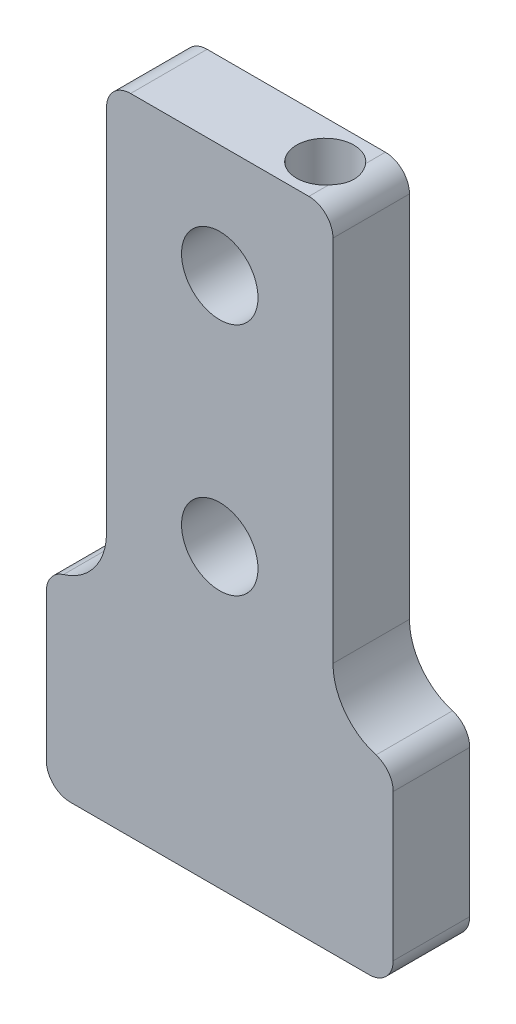
ISO-10303-21;
HEADER;
FILE_DESCRIPTION(('STEP AP214'),'2;1');
FILE_NAME('part.step','',(''),(''),'','','');
FILE_SCHEMA(('AUTOMOTIVE_DESIGN { 1 0 10303 214 1 1 1 1 }'));
ENDSEC;
DATA;
#1=APPLICATION_CONTEXT('core data for automotive mechanical design processes');
#2=APPLICATION_PROTOCOL_DEFINITION('international standard','automotive_design',2000,#1);
#3=PRODUCT_CONTEXT('',#1,'mechanical');
#4=PRODUCT('Part','Part','',(#3));
#5=PRODUCT_RELATED_PRODUCT_CATEGORY('part','',(#4));
#6=PRODUCT_DEFINITION_FORMATION('','',#4);
#7=PRODUCT_DEFINITION_CONTEXT('part definition',#1,'design');
#8=PRODUCT_DEFINITION('design','',#6,#7);
#9=PRODUCT_DEFINITION_SHAPE('','',#8);
#10=(LENGTH_UNIT() NAMED_UNIT(*) SI_UNIT(.MILLI.,.METRE.));
#11=(NAMED_UNIT(*) PLANE_ANGLE_UNIT() SI_UNIT($,.RADIAN.));
#12=(NAMED_UNIT(*) SI_UNIT($,.STERADIAN.) SOLID_ANGLE_UNIT());
#13=UNCERTAINTY_MEASURE_WITH_UNIT(LENGTH_MEASURE(1.E-05),#10,'distance_accuracy_value','');
#14=(GEOMETRIC_REPRESENTATION_CONTEXT(3) GLOBAL_UNCERTAINTY_ASSIGNED_CONTEXT((#13)) GLOBAL_UNIT_ASSIGNED_CONTEXT((#10,
#11,#12)) REPRESENTATION_CONTEXT('',''));
#15=CARTESIAN_POINT('',(0.,0.,0.));
#16=DIRECTION('',(0.,0.,1.));
#17=DIRECTION('',(1.,0.,0.));
#18=AXIS2_PLACEMENT_3D('',#15,#16,#17);
#19=CARTESIAN_POINT('',(-14.398,-3.7,-6.35));
#20=DIRECTION('',(0.,0.,1.));
#21=DIRECTION('',(1.,0.,0.));
#22=AXIS2_PLACEMENT_3D('',#19,#20,#21);
#23=CYLINDRICAL_SURFACE('',#22,5.);
#24=CARTESIAN_POINT('',(-14.398,-3.7,-6.35));
#25=DIRECTION('',(0.,0.,-1.));
#26=DIRECTION('',(1.,0.,0.));
#27=AXIS2_PLACEMENT_3D('',#24,#25,#26);
#28=CIRCLE('',#27,5.);
#29=CARTESIAN_POINT('',(-9.398,-3.7,-6.35));
#30=VERTEX_POINT('',#29);
#31=CARTESIAN_POINT('',(-12.9694285714286,-8.49157423749955,-6.35));
#32=VERTEX_POINT('',#31);
#33=EDGE_CURVE('E197',#30,#32,#28,.T.);
#34=ORIENTED_EDGE('',*,*,#33,.T.);
#35=DIRECTION('',(0.,0.,1.));
#36=VECTOR('',#35,1.);
#37=CARTESIAN_POINT('',(-12.9694285714286,-8.49157423749955,-6.35));
#38=LINE('',#37,#36);
#39=CARTESIAN_POINT('',(-12.9694285714286,-8.49157423749955,0.));
#40=VERTEX_POINT('',#39);
#41=EDGE_CURVE('E244',#32,#40,#38,.T.);
#42=ORIENTED_EDGE('',*,*,#41,.T.);
#43=CARTESIAN_POINT('',(-14.398,-3.7,0.));
#44=DIRECTION('',(0.,0.,-1.));
#45=DIRECTION('',(1.,0.,0.));
#46=AXIS2_PLACEMENT_3D('',#43,#44,#45);
#47=CIRCLE('',#46,5.);
#48=CARTESIAN_POINT('',(-9.398,-3.7,0.));
#49=VERTEX_POINT('',#48);
#50=EDGE_CURVE('E176',#49,#40,#47,.T.);
#51=ORIENTED_EDGE('',*,*,#50,.F.);
#52=DIRECTION('',(0.,0.,1.));
#53=VECTOR('',#52,1.);
#54=CARTESIAN_POINT('',(-9.398,-3.7,-6.35));
#55=LINE('',#54,#53);
#56=EDGE_CURVE('E162',#30,#49,#55,.T.);
#57=ORIENTED_EDGE('',*,*,#56,.F.);
#58=EDGE_LOOP('',(#34,#42,#51,#57));
#59=FACE_BOUND('',#58,.T.);
#60=ADVANCED_FACE('F33',(#59),#23,.F.);
#61=CARTESIAN_POINT('',(-9.398,-3.7,-6.35));
#62=DIRECTION('',(-1.,0.,0.));
#63=DIRECTION('',(0.,0.,1.));
#64=AXIS2_PLACEMENT_3D('',#61,#62,#63);
#65=PLANE('',#64);
#66=DIRECTION('',(0.,-1.,0.));
#67=VECTOR('',#66,1.);
#68=CARTESIAN_POINT('',(-9.398,-3.7,0.));
#69=LINE('',#68,#67);
#70=CARTESIAN_POINT('',(-9.398,26.878,0.));
#71=VERTEX_POINT('',#70);
#72=EDGE_CURVE('E195',#71,#49,#69,.T.);
#73=ORIENTED_EDGE('',*,*,#72,.F.);
#74=DIRECTION('',(0.,0.,1.));
#75=VECTOR('',#74,1.);
#76=CARTESIAN_POINT('',(-9.398,26.878,-6.35));
#77=LINE('',#76,#75);
#78=CARTESIAN_POINT('',(-9.398,26.878,-6.35));
#79=VERTEX_POINT('',#78);
#80=EDGE_CURVE('E343',#71,#79,#77,.F.);
#81=ORIENTED_EDGE('',*,*,#80,.T.);
#82=DIRECTION('',(0.,-1.,0.));
#83=VECTOR('',#82,1.);
#84=CARTESIAN_POINT('',(-9.398,-3.7,-6.35));
#85=LINE('',#84,#83);
#86=EDGE_CURVE('E163',#79,#30,#85,.T.);
#87=ORIENTED_EDGE('',*,*,#86,.T.);
#88=ORIENTED_EDGE('',*,*,#56,.T.);
#89=EDGE_LOOP('',(#73,#81,#87,#88));
#90=FACE_BOUND('',#89,.T.);
#91=ADVANCED_FACE('F272',(#90),#65,.T.);
#92=CARTESIAN_POINT('',(-9.398,28.878,-6.35));
#93=DIRECTION('',(0.,1.,0.));
#94=DIRECTION('',(0.,0.,1.));
#95=AXIS2_PLACEMENT_3D('',#92,#93,#94);
#96=PLANE('',#95);
#97=DIRECTION('',(-1.,0.,0.));
#98=VECTOR('',#97,1.);
#99=CARTESIAN_POINT('',(-9.398,28.878,0.));
#100=LINE('',#99,#98);
#101=CARTESIAN_POINT('',(7.398,28.878,0.));
#102=VERTEX_POINT('',#101);
#103=CARTESIAN_POINT('',(-7.398,28.878,0.));
#104=VERTEX_POINT('',#103);
#105=EDGE_CURVE('E192',#102,#104,#100,.T.);
#106=ORIENTED_EDGE('',*,*,#105,.F.);
#107=DIRECTION('',(0.,0.,1.));
#108=VECTOR('',#107,1.);
#109=CARTESIAN_POINT('',(7.398,28.878,-6.35));
#110=LINE('',#109,#108);
#111=CARTESIAN_POINT('',(7.398,28.878,-1.63559394570502));
#112=VERTEX_POINT('',#111);
#113=EDGE_CURVE('E54',#102,#112,#110,.F.);
#114=ORIENTED_EDGE('',*,*,#113,.T.);
#115=CARTESIAN_POINT('',(5.58125,28.878,-3.175));
#116=DIRECTION('',(0.,1.,0.));
#117=DIRECTION('',(0.,0.,1.));
#118=AXIS2_PLACEMENT_3D('',#115,#116,#117);
#119=CIRCLE('',#118,2.38125);
#120=CARTESIAN_POINT('',(7.398,28.878,-4.71440605429498));
#121=VERTEX_POINT('',#120);
#122=EDGE_CURVE('E330',#121,#112,#119,.T.);
#123=ORIENTED_EDGE('',*,*,#122,.F.);
#124=DIRECTION('',(0.,0.,1.));
#125=VECTOR('',#124,1.);
#126=CARTESIAN_POINT('',(7.398,28.878,-6.35));
#127=LINE('',#126,#125);
#128=CARTESIAN_POINT('',(7.398,28.878,-6.35));
#129=VERTEX_POINT('',#128);
#130=EDGE_CURVE('E234',#121,#129,#127,.F.);
#131=ORIENTED_EDGE('',*,*,#130,.T.);
#132=DIRECTION('',(-1.,0.,0.));
#133=VECTOR('',#132,1.);
#134=CARTESIAN_POINT('',(-9.398,28.878,-6.35));
#135=LINE('',#134,#133);
#136=CARTESIAN_POINT('',(-7.398,28.878,-6.35));
#137=VERTEX_POINT('',#136);
#138=EDGE_CURVE('E169',#129,#137,#135,.T.);
#139=ORIENTED_EDGE('',*,*,#138,.T.);
#140=DIRECTION('',(0.,0.,1.));
#141=VECTOR('',#140,1.);
#142=CARTESIAN_POINT('',(-7.398,28.878,-6.35));
#143=LINE('',#142,#141);
#144=EDGE_CURVE('E231',#137,#104,#143,.T.);
#145=ORIENTED_EDGE('',*,*,#144,.T.);
#146=EDGE_LOOP('',(#106,#114,#123,#131,#139,#145));
#147=FACE_BOUND('',#146,.T.);
#148=ADVANCED_FACE('F275',(#147),#96,.T.);
#149=CARTESIAN_POINT('',(9.398,-3.7,-6.35));
#150=DIRECTION('',(1.,0.,0.));
#151=DIRECTION('',(0.,0.,-1.));
#152=AXIS2_PLACEMENT_3D('',#149,#150,#151);
#153=PLANE('',#152);
#154=DIRECTION('',(0.,1.,0.));
#155=VECTOR('',#154,1.);
#156=CARTESIAN_POINT('',(9.398,-3.7,-6.35));
#157=LINE('',#156,#155);
#158=CARTESIAN_POINT('',(9.398,-3.7,-6.35));
#159=VERTEX_POINT('',#158);
#160=CARTESIAN_POINT('',(9.398,26.878,-6.35));
#161=VERTEX_POINT('',#160);
#162=EDGE_CURVE('E152',#159,#161,#157,.T.);
#163=ORIENTED_EDGE('',*,*,#162,.T.);
#164=DIRECTION('',(0.,0.,1.));
#165=VECTOR('',#164,1.);
#166=CARTESIAN_POINT('',(9.398,26.878,-6.35));
#167=LINE('',#166,#165);
#168=CARTESIAN_POINT('',(9.398,26.878,0.));
#169=VERTEX_POINT('',#168);
#170=EDGE_CURVE('E229',#161,#169,#167,.T.);
#171=ORIENTED_EDGE('',*,*,#170,.T.);
#172=DIRECTION('',(0.,1.,0.));
#173=VECTOR('',#172,1.);
#174=CARTESIAN_POINT('',(9.398,-3.7,0.));
#175=LINE('',#174,#173);
#176=CARTESIAN_POINT('',(9.398,-3.7,0.));
#177=VERTEX_POINT('',#176);
#178=EDGE_CURVE('E161',#177,#169,#175,.T.);
#179=ORIENTED_EDGE('',*,*,#178,.F.);
#180=DIRECTION('',(0.,0.,1.));
#181=VECTOR('',#180,1.);
#182=CARTESIAN_POINT('',(9.398,-3.7,-6.35));
#183=LINE('',#182,#181);
#184=EDGE_CURVE('E145',#159,#177,#183,.T.);
#185=ORIENTED_EDGE('',*,*,#184,.F.);
#186=EDGE_LOOP('',(#163,#171,#179,#185));
#187=FACE_BOUND('',#186,.T.);
#188=ADVANCED_FACE('F157',(#187),#153,.T.);
#189=CARTESIAN_POINT('',(14.398,-3.7,-6.35));
#190=DIRECTION('',(0.,0.,1.));
#191=DIRECTION('',(1.,0.,0.));
#192=AXIS2_PLACEMENT_3D('',#189,#190,#191);
#193=CYLINDRICAL_SURFACE('',#192,5.);
#194=CARTESIAN_POINT('',(14.398,-3.7,0.));
#195=DIRECTION('',(0.,0.,-1.));
#196=DIRECTION('',(1.,0.,0.));
#197=AXIS2_PLACEMENT_3D('',#194,#195,#196);
#198=CIRCLE('',#197,5.);
#199=CARTESIAN_POINT('',(12.9694285714286,-8.49157423749955,0.));
#200=VERTEX_POINT('',#199);
#201=EDGE_CURVE('E189',#200,#177,#198,.T.);
#202=ORIENTED_EDGE('',*,*,#201,.F.);
#203=DIRECTION('',(0.,0.,1.));
#204=VECTOR('',#203,1.);
#205=CARTESIAN_POINT('',(12.9694285714286,-8.49157423749955,-6.35));
#206=LINE('',#205,#204);
#207=CARTESIAN_POINT('',(12.9694285714286,-8.49157423749955,-6.35));
#208=VERTEX_POINT('',#207);
#209=EDGE_CURVE('E148',#200,#208,#206,.F.);
#210=ORIENTED_EDGE('',*,*,#209,.T.);
#211=CARTESIAN_POINT('',(14.398,-3.7,-6.35));
#212=DIRECTION('',(0.,0.,-1.));
#213=DIRECTION('',(1.,0.,0.));
#214=AXIS2_PLACEMENT_3D('',#211,#212,#213);
#215=CIRCLE('',#214,5.);
#216=EDGE_CURVE('E141',#208,#159,#215,.T.);
#217=ORIENTED_EDGE('',*,*,#216,.T.);
#218=ORIENTED_EDGE('',*,*,#184,.T.);
#219=EDGE_LOOP('',(#202,#210,#217,#218));
#220=FACE_BOUND('',#219,.T.);
#221=ADVANCED_FACE('F144',(#220),#193,.F.);
#222=CARTESIAN_POINT('',(14.398,-24.575,-6.35));
#223=DIRECTION('',(1.,0.,0.));
#224=DIRECTION('',(0.,1.,0.));
#225=AXIS2_PLACEMENT_3D('',#222,#223,#224);
#226=PLANE('',#225);
#227=DIRECTION('',(0.,1.,0.));
#228=VECTOR('',#227,1.);
#229=CARTESIAN_POINT('',(14.398,-24.575,-6.35));
#230=LINE('',#229,#228);
#231=CARTESIAN_POINT('',(14.398,-22.575,-6.35));
#232=VERTEX_POINT('',#231);
#233=CARTESIAN_POINT('',(14.398,-10.4082039324994,-6.35));
#234=VERTEX_POINT('',#233);
#235=EDGE_CURVE('E153',#232,#234,#230,.T.);
#236=ORIENTED_EDGE('',*,*,#235,.T.);
#237=DIRECTION('',(0.,0.,1.));
#238=VECTOR('',#237,1.);
#239=CARTESIAN_POINT('',(14.398,-10.4082039324994,-6.35));
#240=LINE('',#239,#238);
#241=CARTESIAN_POINT('',(14.398,-10.4082039324994,0.));
#242=VERTEX_POINT('',#241);
#243=EDGE_CURVE('E202',#234,#242,#240,.T.);
#244=ORIENTED_EDGE('',*,*,#243,.T.);
#245=DIRECTION('',(0.,1.,0.));
#246=VECTOR('',#245,1.);
#247=CARTESIAN_POINT('',(14.398,-24.575,0.));
#248=LINE('',#247,#246);
#249=CARTESIAN_POINT('',(14.398,-22.575,0.));
#250=VERTEX_POINT('',#249);
#251=EDGE_CURVE('E186',#250,#242,#248,.T.);
#252=ORIENTED_EDGE('',*,*,#251,.F.);
#253=DIRECTION('',(0.,0.,1.));
#254=VECTOR('',#253,1.);
#255=CARTESIAN_POINT('',(14.398,-22.575,-6.35));
#256=LINE('',#255,#254);
#257=EDGE_CURVE('E199',#250,#232,#256,.F.);
#258=ORIENTED_EDGE('',*,*,#257,.T.);
#259=EDGE_LOOP('',(#236,#244,#252,#258));
#260=FACE_BOUND('',#259,.T.);
#261=ADVANCED_FACE('F283',(#260),#226,.T.);
#262=CARTESIAN_POINT('',(-14.398,-24.575,-6.35));
#263=DIRECTION('',(0.,-1.,0.));
#264=DIRECTION('',(0.,0.,-1.));
#265=AXIS2_PLACEMENT_3D('',#262,#263,#264);
#266=PLANE('',#265);
#267=CARTESIAN_POINT('',(5.58125,-24.575,-3.175));
#268=DIRECTION('',(0.,1.,0.));
#269=DIRECTION('',(0.,0.,1.));
#270=AXIS2_PLACEMENT_3D('',#267,#268,#269);
#271=CIRCLE('',#270,2.38125);
#272=CARTESIAN_POINT('',(5.58125,-24.575,-0.793749999999998));
#273=VERTEX_POINT('',#272);
#274=EDGE_CURVE('E327',#273,#273,#271,.T.);
#275=ORIENTED_EDGE('',*,*,#274,.T.);
#276=EDGE_LOOP('',(#275));
#277=FACE_BOUND('',#276,.T.);
#278=DIRECTION('',(1.,0.,0.));
#279=VECTOR('',#278,1.);
#280=CARTESIAN_POINT('',(-14.398,-24.575,-6.35));
#281=LINE('',#280,#279);
#282=CARTESIAN_POINT('',(-12.398,-24.575,-6.35));
#283=VERTEX_POINT('',#282);
#284=CARTESIAN_POINT('',(12.398,-24.575,-6.35));
#285=VERTEX_POINT('',#284);
#286=EDGE_CURVE('E309',#283,#285,#281,.T.);
#287=ORIENTED_EDGE('',*,*,#286,.T.);
#288=DIRECTION('',(0.,0.,1.));
#289=VECTOR('',#288,1.);
#290=CARTESIAN_POINT('',(12.398,-24.575,-6.35));
#291=LINE('',#290,#289);
#292=CARTESIAN_POINT('',(12.398,-24.575,0.));
#293=VERTEX_POINT('',#292);
#294=EDGE_CURVE('E11',#285,#293,#291,.T.);
#295=ORIENTED_EDGE('',*,*,#294,.T.);
#296=DIRECTION('',(1.,0.,0.));
#297=VECTOR('',#296,1.);
#298=CARTESIAN_POINT('',(-14.398,-24.575,0.));
#299=LINE('',#298,#297);
#300=CARTESIAN_POINT('',(-12.398,-24.575,0.));
#301=VERTEX_POINT('',#300);
#302=EDGE_CURVE('E183',#301,#293,#299,.T.);
#303=ORIENTED_EDGE('',*,*,#302,.F.);
#304=DIRECTION('',(0.,0.,1.));
#305=VECTOR('',#304,1.);
#306=CARTESIAN_POINT('',(-12.398,-24.575,-6.35));
#307=LINE('',#306,#305);
#308=EDGE_CURVE('E41',#301,#283,#307,.F.);
#309=ORIENTED_EDGE('',*,*,#308,.T.);
#310=EDGE_LOOP('',(#287,#295,#303,#309));
#311=FACE_BOUND('',#310,.T.);
#312=ADVANCED_FACE('F286',(#277,#311),#266,.T.);
#313=CARTESIAN_POINT('',(-14.398,-8.7,-6.35));
#314=DIRECTION('',(-1.,0.,0.));
#315=DIRECTION('',(0.,-1.,0.));
#316=AXIS2_PLACEMENT_3D('',#313,#314,#315);
#317=PLANE('',#316);
#318=DIRECTION('',(0.,-1.,0.));
#319=VECTOR('',#318,1.);
#320=CARTESIAN_POINT('',(-14.398,-8.7,0.));
#321=LINE('',#320,#319);
#322=CARTESIAN_POINT('',(-14.398,-10.4082039324994,0.));
#323=VERTEX_POINT('',#322);
#324=CARTESIAN_POINT('',(-14.398,-22.575,0.));
#325=VERTEX_POINT('',#324);
#326=EDGE_CURVE('E179',#323,#325,#321,.T.);
#327=ORIENTED_EDGE('',*,*,#326,.F.);
#328=DIRECTION('',(0.,0.,1.));
#329=VECTOR('',#328,1.);
#330=CARTESIAN_POINT('',(-14.398,-10.4082039324994,-6.35));
#331=LINE('',#330,#329);
#332=CARTESIAN_POINT('',(-14.398,-10.4082039324994,-6.35));
#333=VERTEX_POINT('',#332);
#334=EDGE_CURVE('E354',#323,#333,#331,.F.);
#335=ORIENTED_EDGE('',*,*,#334,.T.);
#336=DIRECTION('',(0.,-1.,0.));
#337=VECTOR('',#336,1.);
#338=CARTESIAN_POINT('',(-14.398,-8.7,-6.35));
#339=LINE('',#338,#337);
#340=CARTESIAN_POINT('',(-14.398,-22.575,-6.35));
#341=VERTEX_POINT('',#340);
#342=EDGE_CURVE('E311',#333,#341,#339,.T.);
#343=ORIENTED_EDGE('',*,*,#342,.T.);
#344=DIRECTION('',(0.,0.,1.));
#345=VECTOR('',#344,1.);
#346=CARTESIAN_POINT('',(-14.398,-22.575,-6.35));
#347=LINE('',#346,#345);
#348=EDGE_CURVE('E357',#341,#325,#347,.T.);
#349=ORIENTED_EDGE('',*,*,#348,.T.);
#350=EDGE_LOOP('',(#327,#335,#343,#349));
#351=FACE_BOUND('',#350,.T.);
#352=ADVANCED_FACE('F267',(#351),#317,.T.);
#353=CARTESIAN_POINT('',(-14.398,-3.7,-6.35));
#354=DIRECTION('',(0.,0.,1.));
#355=DIRECTION('',(1.,0.,0.));
#356=AXIS2_PLACEMENT_3D('',#353,#354,#355);
#357=PLANE('',#356);
#358=CARTESIAN_POINT('',(0.,19.48,-6.35));
#359=DIRECTION('',(0.,0.,1.));
#360=DIRECTION('',(1.,0.,0.));
#361=AXIS2_PLACEMENT_3D('',#358,#359,#360);
#362=CIRCLE('',#361,3.175);
#363=CARTESIAN_POINT('',(3.175,19.48,-6.35));
#364=VERTEX_POINT('',#363);
#365=EDGE_CURVE('E321',#364,#364,#362,.T.);
#366=ORIENTED_EDGE('',*,*,#365,.T.);
#367=EDGE_LOOP('',(#366));
#368=FACE_BOUND('',#367,.T.);
#369=CARTESIAN_POINT('',(0.,0.,-6.35));
#370=DIRECTION('',(0.,0.,1.));
#371=DIRECTION('',(1.,0.,0.));
#372=AXIS2_PLACEMENT_3D('',#369,#370,#371);
#373=CIRCLE('',#372,3.175);
#374=CARTESIAN_POINT('',(3.175,0.,-6.35));
#375=VERTEX_POINT('',#374);
#376=EDGE_CURVE('E180',#375,#375,#373,.T.);
#377=ORIENTED_EDGE('',*,*,#376,.T.);
#378=EDGE_LOOP('',(#377));
#379=FACE_BOUND('',#378,.T.);
#380=ORIENTED_EDGE('',*,*,#216,.F.);
#381=CARTESIAN_POINT('',(12.398,-10.4082039324994,-6.35));
#382=DIRECTION('',(0.,0.,1.));
#383=DIRECTION('',(1.,0.,0.));
#384=AXIS2_PLACEMENT_3D('',#381,#382,#383);
#385=CIRCLE('',#384,2.);
#386=EDGE_CURVE('E227',#208,#234,#385,.F.);
#387=ORIENTED_EDGE('',*,*,#386,.T.);
#388=ORIENTED_EDGE('',*,*,#235,.F.);
#389=CARTESIAN_POINT('',(12.398,-22.575,-6.35));
#390=DIRECTION('',(0.,0.,1.));
#391=DIRECTION('',(1.,0.,0.));
#392=AXIS2_PLACEMENT_3D('',#389,#390,#391);
#393=CIRCLE('',#392,2.);
#394=EDGE_CURVE('E220',#232,#285,#393,.F.);
#395=ORIENTED_EDGE('',*,*,#394,.T.);
#396=ORIENTED_EDGE('',*,*,#286,.F.);
#397=CARTESIAN_POINT('',(-12.398,-22.575,-6.35));
#398=DIRECTION('',(0.,0.,1.));
#399=DIRECTION('',(1.,0.,0.));
#400=AXIS2_PLACEMENT_3D('',#397,#398,#399);
#401=CIRCLE('',#400,2.);
#402=EDGE_CURVE('E218',#283,#341,#401,.F.);
#403=ORIENTED_EDGE('',*,*,#402,.T.);
#404=ORIENTED_EDGE('',*,*,#342,.F.);
#405=CARTESIAN_POINT('',(-12.398,-10.4082039324994,-6.35));
#406=DIRECTION('',(0.,0.,1.));
#407=DIRECTION('',(1.,0.,0.));
#408=AXIS2_PLACEMENT_3D('',#405,#406,#407);
#409=CIRCLE('',#408,2.);
#410=EDGE_CURVE('E224',#333,#32,#409,.F.);
#411=ORIENTED_EDGE('',*,*,#410,.T.);
#412=ORIENTED_EDGE('',*,*,#33,.F.);
#413=ORIENTED_EDGE('',*,*,#86,.F.);
#414=CARTESIAN_POINT('',(-7.398,26.878,-6.35));
#415=DIRECTION('',(0.,0.,1.));
#416=DIRECTION('',(1.,0.,0.));
#417=AXIS2_PLACEMENT_3D('',#414,#415,#416);
#418=CIRCLE('',#417,2.);
#419=EDGE_CURVE('E222',#79,#137,#418,.F.);
#420=ORIENTED_EDGE('',*,*,#419,.T.);
#421=ORIENTED_EDGE('',*,*,#138,.F.);
#422=CARTESIAN_POINT('',(7.398,26.878,-6.35));
#423=DIRECTION('',(0.,0.,1.));
#424=DIRECTION('',(1.,0.,0.));
#425=AXIS2_PLACEMENT_3D('',#422,#423,#424);
#426=CIRCLE('',#425,2.);
#427=EDGE_CURVE('E168',#129,#161,#426,.F.);
#428=ORIENTED_EDGE('',*,*,#427,.T.);
#429=ORIENTED_EDGE('',*,*,#162,.F.);
#430=EDGE_LOOP('',(#380,#387,#388,#395,#396,#403,#404,#411,#412,#413,#420,#421,#428,#429));
#431=FACE_BOUND('',#430,.T.);
#432=ADVANCED_FACE('F165',(#368,#379,#431),#357,.F.);
#433=CARTESIAN_POINT('',(-14.398,-3.7,0.));
#434=DIRECTION('',(0.,0.,1.));
#435=DIRECTION('',(1.,0.,0.));
#436=AXIS2_PLACEMENT_3D('',#433,#434,#435);
#437=PLANE('',#436);
#438=CARTESIAN_POINT('',(0.,19.48,0.));
#439=DIRECTION('',(0.,0.,1.));
#440=DIRECTION('',(1.,0.,0.));
#441=AXIS2_PLACEMENT_3D('',#438,#439,#440);
#442=CIRCLE('',#441,3.175);
#443=CARTESIAN_POINT('',(3.175,19.48,0.));
#444=VERTEX_POINT('',#443);
#445=EDGE_CURVE('E324',#444,#444,#442,.T.);
#446=ORIENTED_EDGE('',*,*,#445,.F.);
#447=EDGE_LOOP('',(#446));
#448=FACE_BOUND('',#447,.T.);
#449=CARTESIAN_POINT('',(0.,0.,0.));
#450=DIRECTION('',(0.,0.,1.));
#451=DIRECTION('',(1.,0.,0.));
#452=AXIS2_PLACEMENT_3D('',#449,#450,#451);
#453=CIRCLE('',#452,3.175);
#454=CARTESIAN_POINT('',(3.175,0.,0.));
#455=VERTEX_POINT('',#454);
#456=EDGE_CURVE('E318',#455,#455,#453,.T.);
#457=ORIENTED_EDGE('',*,*,#456,.F.);
#458=EDGE_LOOP('',(#457));
#459=FACE_BOUND('',#458,.T.);
#460=ORIENTED_EDGE('',*,*,#251,.T.);
#461=CARTESIAN_POINT('',(12.398,-10.4082039324994,0.));
#462=DIRECTION('',(0.,0.,1.));
#463=DIRECTION('',(1.,0.,0.));
#464=AXIS2_PLACEMENT_3D('',#461,#462,#463);
#465=CIRCLE('',#464,2.);
#466=EDGE_CURVE('E215',#242,#200,#465,.T.);
#467=ORIENTED_EDGE('',*,*,#466,.T.);
#468=ORIENTED_EDGE('',*,*,#201,.T.);
#469=ORIENTED_EDGE('',*,*,#178,.T.);
#470=CARTESIAN_POINT('',(7.398,26.878,0.));
#471=DIRECTION('',(0.,0.,1.));
#472=DIRECTION('',(1.,0.,0.));
#473=AXIS2_PLACEMENT_3D('',#470,#471,#472);
#474=CIRCLE('',#473,2.);
#475=EDGE_CURVE('E213',#169,#102,#474,.T.);
#476=ORIENTED_EDGE('',*,*,#475,.T.);
#477=ORIENTED_EDGE('',*,*,#105,.T.);
#478=CARTESIAN_POINT('',(-7.398,26.878,0.));
#479=DIRECTION('',(0.,0.,1.));
#480=DIRECTION('',(1.,0.,0.));
#481=AXIS2_PLACEMENT_3D('',#478,#479,#480);
#482=CIRCLE('',#481,2.);
#483=EDGE_CURVE('E209',#104,#71,#482,.T.);
#484=ORIENTED_EDGE('',*,*,#483,.T.);
#485=ORIENTED_EDGE('',*,*,#72,.T.);
#486=ORIENTED_EDGE('',*,*,#50,.T.);
#487=CARTESIAN_POINT('',(-12.398,-10.4082039324994,0.));
#488=DIRECTION('',(0.,0.,1.));
#489=DIRECTION('',(1.,0.,0.));
#490=AXIS2_PLACEMENT_3D('',#487,#488,#489);
#491=CIRCLE('',#490,2.);
#492=EDGE_CURVE('E211',#40,#323,#491,.T.);
#493=ORIENTED_EDGE('',*,*,#492,.T.);
#494=ORIENTED_EDGE('',*,*,#326,.T.);
#495=CARTESIAN_POINT('',(-12.398,-22.575,0.));
#496=DIRECTION('',(0.,0.,1.));
#497=DIRECTION('',(1.,0.,0.));
#498=AXIS2_PLACEMENT_3D('',#495,#496,#497);
#499=CIRCLE('',#498,2.);
#500=EDGE_CURVE('E205',#325,#301,#499,.T.);
#501=ORIENTED_EDGE('',*,*,#500,.T.);
#502=ORIENTED_EDGE('',*,*,#302,.T.);
#503=CARTESIAN_POINT('',(12.398,-22.575,0.));
#504=DIRECTION('',(0.,0.,1.));
#505=DIRECTION('',(1.,0.,0.));
#506=AXIS2_PLACEMENT_3D('',#503,#504,#505);
#507=CIRCLE('',#506,2.);
#508=EDGE_CURVE('E207',#293,#250,#507,.T.);
#509=ORIENTED_EDGE('',*,*,#508,.T.);
#510=EDGE_LOOP('',(#460,#467,#468,#469,#476,#477,#484,#485,#486,#493,#494,#501,#502,#509));
#511=FACE_BOUND('',#510,.T.);
#512=ADVANCED_FACE('F263',(#448,#459,#511),#437,.T.);
#513=CARTESIAN_POINT('',(0.,0.,-6.35));
#514=DIRECTION('',(0.,0.,1.));
#515=DIRECTION('',(1.,0.,0.));
#516=AXIS2_PLACEMENT_3D('',#513,#514,#515);
#517=CYLINDRICAL_SURFACE('',#516,3.175);
#518=ORIENTED_EDGE('',*,*,#376,.F.);
#519=EDGE_LOOP('',(#518));
#520=FACE_BOUND('',#519,.T.);
#521=ORIENTED_EDGE('',*,*,#456,.T.);
#522=EDGE_LOOP('',(#521));
#523=FACE_BOUND('',#522,.T.);
#524=ADVANCED_FACE('F259',(#520,#523),#517,.F.);
#525=CARTESIAN_POINT('',(0.,19.48,-6.35));
#526=DIRECTION('',(0.,0.,1.));
#527=DIRECTION('',(1.,0.,0.));
#528=AXIS2_PLACEMENT_3D('',#525,#526,#527);
#529=CYLINDRICAL_SURFACE('',#528,3.175);
#530=ORIENTED_EDGE('',*,*,#365,.F.);
#531=EDGE_LOOP('',(#530));
#532=FACE_BOUND('',#531,.T.);
#533=ORIENTED_EDGE('',*,*,#445,.T.);
#534=EDGE_LOOP('',(#533));
#535=FACE_BOUND('',#534,.T.);
#536=ADVANCED_FACE('F255',(#532,#535),#529,.F.);
#537=CARTESIAN_POINT('',(5.58125,-24.575,-3.175));
#538=DIRECTION('',(0.,1.,0.));
#539=DIRECTION('',(0.,0.,1.));
#540=AXIS2_PLACEMENT_3D('',#537,#538,#539);
#541=CYLINDRICAL_SURFACE('',#540,2.38125);
#542=ORIENTED_EDGE('',*,*,#274,.F.);
#543=EDGE_LOOP('',(#542));
#544=FACE_BOUND('',#543,.T.);
#545=ORIENTED_EDGE('',*,*,#122,.T.);
#546=CARTESIAN_POINT('',(7.398,28.878,-1.63559394570502));
#547=CARTESIAN_POINT('',(7.44070593429424,28.8779930530136,-1.68598311603319));
#548=CARTESIAN_POINT('',(7.48128487894801,28.8766323685446,-1.73813453694972));
#549=CARTESIAN_POINT('',(7.55791942934718,28.8719672432674,-1.84553757795824));
#550=CARTESIAN_POINT('',(7.59397768604332,28.8686639481437,-1.90078735338818));
#551=CARTESIAN_POINT('',(7.66136974727304,28.8608735105446,-2.01405225350326));
#552=CARTESIAN_POINT('',(7.69270110984115,28.8563857594353,-2.07206878729664));
#553=CARTESIAN_POINT('',(7.75043552457287,28.8469189129196,-2.19045516358592));
#554=CARTESIAN_POINT('',(7.77683788073182,28.8419397482744,-2.25082533697685));
#555=CARTESIAN_POINT('',(7.84835086244102,28.8272517353957,-2.4348137059703));
#556=CARTESIAN_POINT('',(7.88588396468052,28.8177745042944,-2.56150610969866));
#557=CARTESIAN_POINT('',(7.93948022004,28.8035080651956,-2.81942018291786));
#558=CARTESIAN_POINT('',(7.95556952879837,28.7987131479522,-2.95063613402431));
#559=CARTESIAN_POINT('',(7.96582264185042,28.7957100259598,-3.21402213142857));
#560=CARTESIAN_POINT('',(7.95998686009091,28.7975016968558,-3.34619215966632));
#561=CARTESIAN_POINT('',(7.92657226728702,28.8069630295683,-3.60768834180115));
#562=CARTESIAN_POINT('',(7.89896447028509,28.8146405270419,-3.73701046806909));
#563=CARTESIAN_POINT('',(7.82337648076987,28.8326180134344,-3.98749265002982));
#564=CARTESIAN_POINT('',(7.77565916054806,28.842883499853,-4.1087354338789));
#565=CARTESIAN_POINT('',(7.66109812794328,28.8614617494545,-4.34177193300947));
#566=CARTESIAN_POINT('',(7.59430265788912,28.8697793428648,-4.45358857169141));
#567=CARTESIAN_POINT('',(7.49979862632555,28.8754984042182,-4.58588808693477));
#568=CARTESIAN_POINT('',(7.48017906963245,28.8764125659586,-4.61218456486313));
#569=CARTESIAN_POINT('',(7.4398802543221,28.8776631318427,-4.66393132194324));
#570=CARTESIAN_POINT('',(7.41920188974956,28.8780000154104,-4.68938228604156));
#571=CARTESIAN_POINT('',(7.39799999999999,28.878,-4.71440605429498));
#572=B_SPLINE_CURVE_WITH_KNOTS('',3,(#546,#547,#548,#549,#550,#551,#552,#553,#554,#555,#556,
#557,#558,#559,#560,#561,#562,#563,#564,#565,#566,#567,#568,#569,#570,#571),.UNSPECIFIED.,.F.,
.F.,(4,2,2,2,2,2,2,2,2,2,2,2,4),(0.,0.198040574671326,0.395964468848705,0.59399026511192,
0.792044002666481,1.18747260148053,1.58241844141649,1.97735682479285,2.37282189495411,
2.76327037612687,3.15274015300353,3.25118331049202,3.34954467217971),.UNSPECIFIED.);
#573=EDGE_CURVE('E47',#112,#121,#572,.T.);
#574=ORIENTED_EDGE('',*,*,#573,.T.);
#575=EDGE_LOOP('',(#545,#574));
#576=FACE_BOUND('',#575,.T.);
#577=ADVANCED_FACE('F250',(#544,#576),#541,.F.);
#578=CARTESIAN_POINT('',(12.398,-10.4082039324994,-6.35));
#579=DIRECTION('',(0.,0.,1.));
#580=DIRECTION('',(1.,0.,0.));
#581=AXIS2_PLACEMENT_3D('',#578,#579,#580);
#582=CYLINDRICAL_SURFACE('',#581,2.);
#583=ORIENTED_EDGE('',*,*,#386,.F.);
#584=ORIENTED_EDGE('',*,*,#209,.F.);
#585=ORIENTED_EDGE('',*,*,#466,.F.);
#586=ORIENTED_EDGE('',*,*,#243,.F.);
#587=EDGE_LOOP('',(#583,#584,#585,#586));
#588=FACE_BOUND('',#587,.T.);
#589=ADVANCED_FACE('F254',(#588),#582,.T.);
#590=CARTESIAN_POINT('',(7.398,26.878,-6.35));
#591=DIRECTION('',(0.,0.,1.));
#592=DIRECTION('',(1.,0.,0.));
#593=AXIS2_PLACEMENT_3D('',#590,#591,#592);
#594=CYLINDRICAL_SURFACE('',#593,2.);
#595=ORIENTED_EDGE('',*,*,#573,.F.);
#596=ORIENTED_EDGE('',*,*,#113,.F.);
#597=ORIENTED_EDGE('',*,*,#475,.F.);
#598=ORIENTED_EDGE('',*,*,#170,.F.);
#599=ORIENTED_EDGE('',*,*,#427,.F.);
#600=ORIENTED_EDGE('',*,*,#130,.F.);
#601=EDGE_LOOP('',(#595,#596,#597,#598,#599,#600));
#602=FACE_BOUND('',#601,.T.);
#603=ADVANCED_FACE('F246',(#602),#594,.T.);
#604=CARTESIAN_POINT('',(-12.398,-10.4082039324994,-6.35));
#605=DIRECTION('',(0.,0.,1.));
#606=DIRECTION('',(1.,0.,0.));
#607=AXIS2_PLACEMENT_3D('',#604,#605,#606);
#608=CYLINDRICAL_SURFACE('',#607,2.);
#609=ORIENTED_EDGE('',*,*,#410,.F.);
#610=ORIENTED_EDGE('',*,*,#334,.F.);
#611=ORIENTED_EDGE('',*,*,#492,.F.);
#612=ORIENTED_EDGE('',*,*,#41,.F.);
#613=EDGE_LOOP('',(#609,#610,#611,#612));
#614=FACE_BOUND('',#613,.T.);
#615=ADVANCED_FACE('F301',(#614),#608,.T.);
#616=CARTESIAN_POINT('',(-7.398,26.878,-6.35));
#617=DIRECTION('',(0.,0.,1.));
#618=DIRECTION('',(1.,0.,0.));
#619=AXIS2_PLACEMENT_3D('',#616,#617,#618);
#620=CYLINDRICAL_SURFACE('',#619,2.);
#621=ORIENTED_EDGE('',*,*,#419,.F.);
#622=ORIENTED_EDGE('',*,*,#80,.F.);
#623=ORIENTED_EDGE('',*,*,#483,.F.);
#624=ORIENTED_EDGE('',*,*,#144,.F.);
#625=EDGE_LOOP('',(#621,#622,#623,#624));
#626=FACE_BOUND('',#625,.T.);
#627=ADVANCED_FACE('F342',(#626),#620,.T.);
#628=CARTESIAN_POINT('',(12.398,-22.575,-6.35));
#629=DIRECTION('',(0.,0.,1.));
#630=DIRECTION('',(1.,0.,0.));
#631=AXIS2_PLACEMENT_3D('',#628,#629,#630);
#632=CYLINDRICAL_SURFACE('',#631,2.);
#633=ORIENTED_EDGE('',*,*,#394,.F.);
#634=ORIENTED_EDGE('',*,*,#257,.F.);
#635=ORIENTED_EDGE('',*,*,#508,.F.);
#636=ORIENTED_EDGE('',*,*,#294,.F.);
#637=EDGE_LOOP('',(#633,#634,#635,#636));
#638=FACE_BOUND('',#637,.T.);
#639=ADVANCED_FACE('F347',(#638),#632,.T.);
#640=CARTESIAN_POINT('',(-12.398,-22.575,-6.35));
#641=DIRECTION('',(0.,0.,1.));
#642=DIRECTION('',(1.,0.,0.));
#643=AXIS2_PLACEMENT_3D('',#640,#641,#642);
#644=CYLINDRICAL_SURFACE('',#643,2.);
#645=ORIENTED_EDGE('',*,*,#402,.F.);
#646=ORIENTED_EDGE('',*,*,#308,.F.);
#647=ORIENTED_EDGE('',*,*,#500,.F.);
#648=ORIENTED_EDGE('',*,*,#348,.F.);
#649=EDGE_LOOP('',(#645,#646,#647,#648));
#650=FACE_BOUND('',#649,.T.);
#651=ADVANCED_FACE('F35',(#650),#644,.T.);
#652=CLOSED_SHELL('',(#60,#91,#148,#188,#221,#261,#312,#352,#432,#512,#524,#536,#577,#589,#603,
#615,#627,#639,#651));
#653=MANIFOLD_SOLID_BREP('B2',#652);
#654=ADVANCED_BREP_SHAPE_REPRESENTATION('',(#18,#653),#14);
#655=SHAPE_DEFINITION_REPRESENTATION(#9,#654);
ENDSEC;
END-ISO-10303-21;
